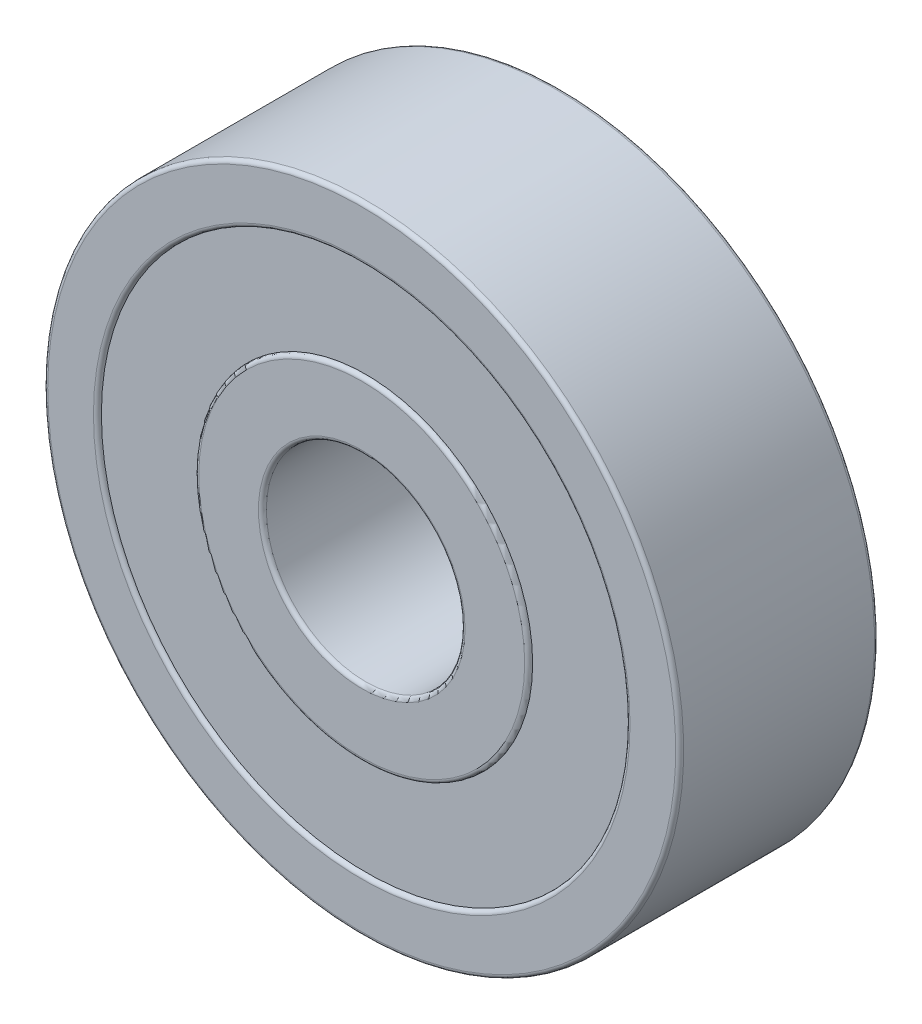
ISO-10303-21;
HEADER;
FILE_DESCRIPTION(('STEP AP214'),'2;1');
FILE_NAME('part.step','',(''),(''),'','','');
FILE_SCHEMA(('AUTOMOTIVE_DESIGN { 1 0 10303 214 1 1 1 1 }'));
ENDSEC;
DATA;
#1=APPLICATION_CONTEXT('core data for automotive mechanical design processes');
#2=APPLICATION_PROTOCOL_DEFINITION('international standard','automotive_design',2000,#1);
#3=PRODUCT_CONTEXT('',#1,'mechanical');
#4=PRODUCT('Part','Part','',(#3));
#5=PRODUCT_RELATED_PRODUCT_CATEGORY('part','',(#4));
#6=PRODUCT_DEFINITION_FORMATION('','',#4);
#7=PRODUCT_DEFINITION_CONTEXT('part definition',#1,'design');
#8=PRODUCT_DEFINITION('design','',#6,#7);
#9=PRODUCT_DEFINITION_SHAPE('','',#8);
#10=(LENGTH_UNIT() NAMED_UNIT(*) SI_UNIT(.MILLI.,.METRE.));
#11=(NAMED_UNIT(*) PLANE_ANGLE_UNIT() SI_UNIT($,.RADIAN.));
#12=(NAMED_UNIT(*) SI_UNIT($,.STERADIAN.) SOLID_ANGLE_UNIT());
#13=UNCERTAINTY_MEASURE_WITH_UNIT(LENGTH_MEASURE(1.E-05),#10,'distance_accuracy_value','');
#14=(GEOMETRIC_REPRESENTATION_CONTEXT(3) GLOBAL_UNCERTAINTY_ASSIGNED_CONTEXT((#13)) GLOBAL_UNIT_ASSIGNED_CONTEXT((#10,
#11,#12)) REPRESENTATION_CONTEXT('',''));
#15=CARTESIAN_POINT('',(0.,0.,0.));
#16=DIRECTION('',(0.,0.,1.));
#17=DIRECTION('',(1.,0.,0.));
#18=AXIS2_PLACEMENT_3D('',#15,#16,#17);
#19=CARTESIAN_POINT('',(0.,0.,4.));
#20=DIRECTION('',(0.,0.,1.));
#21=DIRECTION('',(1.,0.,0.));
#22=AXIS2_PLACEMENT_3D('',#19,#20,#21);
#23=PLANE('',#22);
#24=CARTESIAN_POINT('',(0.,0.,4.));
#25=DIRECTION('',(0.,0.,1.));
#26=DIRECTION('',(-1.,0.,0.));
#27=AXIS2_PLACEMENT_3D('',#24,#25,#26);
#28=CIRCLE('',#27,4.2);
#29=CARTESIAN_POINT('',(4.2,0.,4.));
#30=VERTEX_POINT('',#29);
#31=EDGE_CURVE('P0_E130',#30,#30,#28,.T.);
#32=ORIENTED_EDGE('',*,*,#31,.F.);
#33=EDGE_LOOP('',(#32));
#34=FACE_BOUND('',#33,.T.);
#35=CARTESIAN_POINT('',(0.,0.,4.));
#36=DIRECTION('',(0.,0.,-1.));
#37=DIRECTION('',(-1.,0.,0.));
#38=AXIS2_PLACEMENT_3D('',#35,#36,#37);
#39=CIRCLE('',#38,6.65);
#40=CARTESIAN_POINT('',(6.65,0.,4.));
#41=VERTEX_POINT('',#40);
#42=EDGE_CURVE('P0_E235',#41,#41,#39,.T.);
#43=ORIENTED_EDGE('',*,*,#42,.F.);
#44=EDGE_LOOP('',(#43));
#45=FACE_BOUND('',#44,.T.);
#46=ADVANCED_FACE('P0_F17',(#34,#45),#23,.T.);
#47=CARTESIAN_POINT('',(0.,0.,1.));
#48=DIRECTION('',(0.,0.,-1.));
#49=DIRECTION('',(0.,-1.,0.));
#50=AXIS2_PLACEMENT_3D('',#47,#48,#49);
#51=PLANE('',#50);
#52=CARTESIAN_POINT('',(0.,0.,1.));
#53=DIRECTION('',(0.,0.,-1.));
#54=DIRECTION('',(1.,0.,0.));
#55=AXIS2_PLACEMENT_3D('',#52,#53,#54);
#56=CIRCLE('',#55,4.2);
#57=CARTESIAN_POINT('',(-4.2,0.,1.));
#58=VERTEX_POINT('',#57);
#59=EDGE_CURVE('P0_E185',#58,#58,#56,.T.);
#60=ORIENTED_EDGE('',*,*,#59,.F.);
#61=EDGE_LOOP('',(#60));
#62=FACE_BOUND('',#61,.T.);
#63=CARTESIAN_POINT('',(0.,0.,1.));
#64=DIRECTION('',(0.,0.,1.));
#65=DIRECTION('',(1.,0.,0.));
#66=AXIS2_PLACEMENT_3D('',#63,#64,#65);
#67=CIRCLE('',#66,6.65);
#68=CARTESIAN_POINT('',(-6.65,0.,1.));
#69=VERTEX_POINT('',#68);
#70=EDGE_CURVE('P0_E226',#69,#69,#67,.T.);
#71=ORIENTED_EDGE('',*,*,#70,.F.);
#72=EDGE_LOOP('',(#71));
#73=FACE_BOUND('',#72,.T.);
#74=ADVANCED_FACE('P0_F19',(#62,#73),#51,.T.);
#75=CARTESIAN_POINT('',(0.,0.,4.9));
#76=DIRECTION('',(0.,0.,1.));
#77=DIRECTION('',(1.,0.,0.));
#78=AXIS2_PLACEMENT_3D('',#75,#76,#77);
#79=TOROIDAL_SURFACE('',#78,7.9,0.1);
#80=CARTESIAN_POINT('',(0.,0.,5.));
#81=DIRECTION('',(0.,0.,-1.));
#82=DIRECTION('',(1.,0.,0.));
#83=AXIS2_PLACEMENT_3D('',#80,#81,#82);
#84=CIRCLE('',#83,7.9);
#85=CARTESIAN_POINT('',(-7.9,0.,5.));
#86=VERTEX_POINT('',#85);
#87=EDGE_CURVE('P0_E254',#86,#86,#84,.T.);
#88=ORIENTED_EDGE('',*,*,#87,.T.);
#89=CARTESIAN_POINT('',(-7.9,0.,4.9));
#90=DIRECTION('',(0.,-1.,0.));
#91=DIRECTION('',(-1.,0.,0.));
#92=AXIS2_PLACEMENT_3D('',#89,#90,#91);
#93=CIRCLE('',#92,0.1);
#94=CARTESIAN_POINT('',(-8.,0.,4.9));
#95=VERTEX_POINT('',#94);
#96=EDGE_CURVE('P0_E11',#86,#95,#93,.T.);
#97=ORIENTED_EDGE('',*,*,#96,.T.);
#98=CARTESIAN_POINT('',(0.,0.,4.9));
#99=DIRECTION('',(0.,0.,1.));
#100=DIRECTION('',(1.,0.,0.));
#101=AXIS2_PLACEMENT_3D('',#98,#99,#100);
#102=CIRCLE('',#101,8.);
#103=EDGE_CURVE('P0_E201',#95,#95,#102,.T.);
#104=ORIENTED_EDGE('',*,*,#103,.T.);
#105=ORIENTED_EDGE('',*,*,#96,.F.);
#106=EDGE_LOOP('',(#88,#97,#104,#105));
#107=FACE_BOUND('',#106,.T.);
#108=ADVANCED_FACE('P0_F292',(#107),#79,.T.);
#109=CARTESIAN_POINT('',(0.,0.,0.));
#110=DIRECTION('',(0.,0.,1.));
#111=DIRECTION('',(1.,0.,0.));
#112=AXIS2_PLACEMENT_3D('',#109,#110,#111);
#113=CYLINDRICAL_SURFACE('',#112,8.);
#114=ORIENTED_EDGE('',*,*,#103,.F.);
#115=DIRECTION('',(0.,0.,-1.));
#116=VECTOR('',#115,1.);
#117=CARTESIAN_POINT('',(-8.,0.,0.));
#118=LINE('',#117,#116);
#119=CARTESIAN_POINT('',(-8.,0.,0.1));
#120=VERTEX_POINT('',#119);
#121=EDGE_CURVE('P0_E27',#95,#120,#118,.T.);
#122=ORIENTED_EDGE('',*,*,#121,.T.);
#123=CARTESIAN_POINT('',(0.,0.,0.1));
#124=DIRECTION('',(0.,0.,-1.));
#125=DIRECTION('',(1.,0.,0.));
#126=AXIS2_PLACEMENT_3D('',#123,#124,#125);
#127=CIRCLE('',#126,8.);
#128=EDGE_CURVE('P0_E137',#120,#120,#127,.T.);
#129=ORIENTED_EDGE('',*,*,#128,.F.);
#130=ORIENTED_EDGE('',*,*,#121,.F.);
#131=EDGE_LOOP('',(#114,#122,#129,#130));
#132=FACE_BOUND('',#131,.T.);
#133=ADVANCED_FACE('P0_F210',(#132),#113,.T.);
#134=CARTESIAN_POINT('',(0.,0.,0.1));
#135=DIRECTION('',(0.,0.,1.));
#136=DIRECTION('',(1.,0.,0.));
#137=AXIS2_PLACEMENT_3D('',#134,#135,#136);
#138=TOROIDAL_SURFACE('',#137,7.9,0.1);
#139=ORIENTED_EDGE('',*,*,#128,.T.);
#140=CARTESIAN_POINT('',(-7.9,0.,0.1));
#141=DIRECTION('',(0.,-1.,0.));
#142=DIRECTION('',(-1.,0.,0.));
#143=AXIS2_PLACEMENT_3D('',#140,#141,#142);
#144=CIRCLE('',#143,0.1);
#145=CARTESIAN_POINT('',(-7.9,0.,0.));
#146=VERTEX_POINT('',#145);
#147=EDGE_CURVE('P0_E145',#120,#146,#144,.T.);
#148=ORIENTED_EDGE('',*,*,#147,.T.);
#149=CARTESIAN_POINT('',(0.,0.,0.));
#150=DIRECTION('',(0.,0.,1.));
#151=DIRECTION('',(1.,0.,0.));
#152=AXIS2_PLACEMENT_3D('',#149,#150,#151);
#153=CIRCLE('',#152,7.9);
#154=EDGE_CURVE('P0_E215',#146,#146,#153,.T.);
#155=ORIENTED_EDGE('',*,*,#154,.T.);
#156=ORIENTED_EDGE('',*,*,#147,.F.);
#157=EDGE_LOOP('',(#139,#148,#155,#156));
#158=FACE_BOUND('',#157,.T.);
#159=ADVANCED_FACE('P0_F213',(#158),#138,.T.);
#160=CARTESIAN_POINT('',(0.,0.,5.));
#161=DIRECTION('',(0.,0.,-1.));
#162=DIRECTION('',(-1.,0.,0.));
#163=AXIS2_PLACEMENT_3D('',#160,#161,#162);
#164=CYLINDRICAL_SURFACE('',#163,4.2);
#165=CARTESIAN_POINT('',(0.,0.,4.9));
#166=DIRECTION('',(0.,0.,1.));
#167=DIRECTION('',(-1.,0.,0.));
#168=AXIS2_PLACEMENT_3D('',#165,#166,#167);
#169=CIRCLE('',#168,4.2);
#170=CARTESIAN_POINT('',(4.2,0.,4.9));
#171=VERTEX_POINT('',#170);
#172=CARTESIAN_POINT('',(-4.2,0.,4.9));
#173=VERTEX_POINT('',#172);
#174=EDGE_CURVE('P0_E147',#171,#173,#169,.T.);
#175=ORIENTED_EDGE('',*,*,#174,.F.);
#176=DIRECTION('',(0.,0.,-1.));
#177=VECTOR('',#176,1.);
#178=CARTESIAN_POINT('',(4.2,0.,5.));
#179=LINE('',#178,#177);
#180=EDGE_CURVE('P0_E134',#171,#30,#179,.T.);
#181=ORIENTED_EDGE('',*,*,#180,.T.);
#182=ORIENTED_EDGE('',*,*,#31,.T.);
#183=ORIENTED_EDGE('',*,*,#180,.F.);
#184=CARTESIAN_POINT('',(0.,0.,4.9));
#185=DIRECTION('',(0.,0.,1.));
#186=DIRECTION('',(-1.,0.,0.));
#187=AXIS2_PLACEMENT_3D('',#184,#185,#186);
#188=CIRCLE('',#187,4.2);
#189=EDGE_CURVE('P0_E193',#173,#171,#188,.T.);
#190=ORIENTED_EDGE('',*,*,#189,.F.);
#191=EDGE_LOOP('',(#175,#181,#182,#183,#190));
#192=FACE_BOUND('',#191,.T.);
#193=ADVANCED_FACE('P0_F132',(#192),#164,.T.);
#194=CARTESIAN_POINT('',(0.,0.,4.9));
#195=DIRECTION('',(0.,0.,1.));
#196=DIRECTION('',(1.,0.,0.));
#197=AXIS2_PLACEMENT_3D('',#194,#195,#196);
#198=TOROIDAL_SURFACE('',#197,4.1,0.1);
#199=CARTESIAN_POINT('',(0.,0.,5.));
#200=DIRECTION('',(0.,0.,-1.));
#201=DIRECTION('',(-1.,0.,0.));
#202=AXIS2_PLACEMENT_3D('',#199,#200,#201);
#203=CIRCLE('',#202,4.1);
#204=CARTESIAN_POINT('',(-4.1,0.,5.));
#205=VERTEX_POINT('',#204);
#206=EDGE_CURVE('P0_E172',#205,#205,#203,.T.);
#207=ORIENTED_EDGE('',*,*,#206,.T.);
#208=CARTESIAN_POINT('',(-4.1,0.,4.9));
#209=DIRECTION('',(0.,-1.,0.));
#210=DIRECTION('',(-1.,0.,0.));
#211=AXIS2_PLACEMENT_3D('',#208,#209,#210);
#212=CIRCLE('',#211,0.1);
#213=EDGE_CURVE('P0_E189',#205,#173,#212,.T.);
#214=ORIENTED_EDGE('',*,*,#213,.T.);
#215=ORIENTED_EDGE('',*,*,#189,.T.);
#216=ORIENTED_EDGE('',*,*,#174,.T.);
#217=ORIENTED_EDGE('',*,*,#213,.F.);
#218=EDGE_LOOP('',(#207,#214,#215,#216,#217));
#219=FACE_BOUND('',#218,.T.);
#220=ADVANCED_FACE('P0_F341',(#219),#198,.T.);
#221=CARTESIAN_POINT('',(0.,0.,0.));
#222=DIRECTION('',(0.,0.,1.));
#223=DIRECTION('',(1.,0.,0.));
#224=AXIS2_PLACEMENT_3D('',#221,#222,#223);
#225=CYLINDRICAL_SURFACE('',#224,4.2);
#226=CARTESIAN_POINT('',(0.,0.,0.1));
#227=DIRECTION('',(0.,0.,-1.));
#228=DIRECTION('',(1.,0.,0.));
#229=AXIS2_PLACEMENT_3D('',#226,#227,#228);
#230=CIRCLE('',#229,4.2);
#231=CARTESIAN_POINT('',(-4.2,0.,0.1));
#232=VERTEX_POINT('',#231);
#233=CARTESIAN_POINT('',(4.2,0.,0.1));
#234=VERTEX_POINT('',#233);
#235=EDGE_CURVE('P0_E186',#232,#234,#230,.T.);
#236=ORIENTED_EDGE('',*,*,#235,.F.);
#237=DIRECTION('',(0.,0.,1.));
#238=VECTOR('',#237,1.);
#239=CARTESIAN_POINT('',(-4.2,0.,0.));
#240=LINE('',#239,#238);
#241=EDGE_CURVE('P0_E181',#232,#58,#240,.T.);
#242=ORIENTED_EDGE('',*,*,#241,.T.);
#243=ORIENTED_EDGE('',*,*,#59,.T.);
#244=ORIENTED_EDGE('',*,*,#241,.F.);
#245=CARTESIAN_POINT('',(0.,0.,0.1));
#246=DIRECTION('',(0.,0.,-1.));
#247=DIRECTION('',(1.,0.,0.));
#248=AXIS2_PLACEMENT_3D('',#245,#246,#247);
#249=CIRCLE('',#248,4.2);
#250=EDGE_CURVE('P0_E180',#234,#232,#249,.T.);
#251=ORIENTED_EDGE('',*,*,#250,.F.);
#252=EDGE_LOOP('',(#236,#242,#243,#244,#251));
#253=FACE_BOUND('',#252,.T.);
#254=ADVANCED_FACE('P0_F344',(#253),#225,.T.);
#255=CARTESIAN_POINT('',(0.,0.,0.1));
#256=DIRECTION('',(0.,0.,-1.));
#257=DIRECTION('',(-1.,0.,0.));
#258=AXIS2_PLACEMENT_3D('',#255,#256,#257);
#259=TOROIDAL_SURFACE('',#258,4.1,0.1);
#260=CARTESIAN_POINT('',(0.,0.,0.));
#261=DIRECTION('',(0.,0.,1.));
#262=DIRECTION('',(1.,0.,0.));
#263=AXIS2_PLACEMENT_3D('',#260,#261,#262);
#264=CIRCLE('',#263,4.1);
#265=CARTESIAN_POINT('',(4.1,0.,0.));
#266=VERTEX_POINT('',#265);
#267=EDGE_CURVE('P0_E164',#266,#266,#264,.T.);
#268=ORIENTED_EDGE('',*,*,#267,.T.);
#269=CARTESIAN_POINT('',(4.1,0.,0.1));
#270=DIRECTION('',(0.,-1.,0.));
#271=DIRECTION('',(1.,0.,0.));
#272=AXIS2_PLACEMENT_3D('',#269,#270,#271);
#273=CIRCLE('',#272,0.1);
#274=EDGE_CURVE('P0_E176',#266,#234,#273,.T.);
#275=ORIENTED_EDGE('',*,*,#274,.T.);
#276=ORIENTED_EDGE('',*,*,#250,.T.);
#277=ORIENTED_EDGE('',*,*,#235,.T.);
#278=ORIENTED_EDGE('',*,*,#274,.F.);
#279=EDGE_LOOP('',(#268,#275,#276,#277,#278));
#280=FACE_BOUND('',#279,.T.);
#281=ADVANCED_FACE('P0_F348',(#280),#259,.T.);
#282=CARTESIAN_POINT('',(0.,0.,5.));
#283=DIRECTION('',(0.,0.,1.));
#284=DIRECTION('',(1.,0.,0.));
#285=AXIS2_PLACEMENT_3D('',#282,#283,#284);
#286=PLANE('',#285);
#287=CARTESIAN_POINT('',(0.,0.,5.));
#288=DIRECTION('',(0.,0.,1.));
#289=DIRECTION('',(1.,0.,0.));
#290=AXIS2_PLACEMENT_3D('',#287,#288,#289);
#291=CIRCLE('',#290,2.6);
#292=CARTESIAN_POINT('',(2.6,0.,5.));
#293=VERTEX_POINT('',#292);
#294=EDGE_CURVE('P0_E168',#293,#293,#291,.T.);
#295=ORIENTED_EDGE('',*,*,#294,.F.);
#296=EDGE_LOOP('',(#295));
#297=FACE_BOUND('',#296,.T.);
#298=ORIENTED_EDGE('',*,*,#206,.F.);
#299=EDGE_LOOP('',(#298));
#300=FACE_BOUND('',#299,.T.);
#301=ADVANCED_FACE('P0_F317',(#297,#300),#286,.T.);
#302=CARTESIAN_POINT('',(0.,0.,4.9));
#303=DIRECTION('',(0.,0.,-1.));
#304=DIRECTION('',(-1.,0.,0.));
#305=AXIS2_PLACEMENT_3D('',#302,#303,#304);
#306=TOROIDAL_SURFACE('',#305,2.6,0.1);
#307=ORIENTED_EDGE('',*,*,#294,.T.);
#308=CARTESIAN_POINT('',(2.6,0.,4.9));
#309=DIRECTION('',(0.,-1.,0.));
#310=DIRECTION('',(1.,0.,0.));
#311=AXIS2_PLACEMENT_3D('',#308,#309,#310);
#312=CIRCLE('',#311,0.1);
#313=CARTESIAN_POINT('',(2.5,0.,4.9));
#314=VERTEX_POINT('',#313);
#315=EDGE_CURVE('P0_E169',#293,#314,#312,.T.);
#316=ORIENTED_EDGE('',*,*,#315,.T.);
#317=CARTESIAN_POINT('',(0.,0.,4.9));
#318=DIRECTION('',(0.,0.,-1.));
#319=DIRECTION('',(1.,0.,0.));
#320=AXIS2_PLACEMENT_3D('',#317,#318,#319);
#321=CIRCLE('',#320,2.5);
#322=CARTESIAN_POINT('',(-2.5,0.,4.9));
#323=VERTEX_POINT('',#322);
#324=EDGE_CURVE('P0_E161',#314,#323,#321,.T.);
#325=ORIENTED_EDGE('',*,*,#324,.T.);
#326=CARTESIAN_POINT('',(0.,0.,4.9));
#327=DIRECTION('',(0.,0.,-1.));
#328=DIRECTION('',(1.,0.,0.));
#329=AXIS2_PLACEMENT_3D('',#326,#327,#328);
#330=CIRCLE('',#329,2.5);
#331=EDGE_CURVE('P0_E153',#323,#314,#330,.T.);
#332=ORIENTED_EDGE('',*,*,#331,.T.);
#333=ORIENTED_EDGE('',*,*,#315,.F.);
#334=EDGE_LOOP('',(#307,#316,#325,#332,#333));
#335=FACE_BOUND('',#334,.T.);
#336=ADVANCED_FACE('P0_F311',(#335),#306,.T.);
#337=CARTESIAN_POINT('',(0.,0.,0.));
#338=DIRECTION('',(0.,0.,1.));
#339=DIRECTION('',(1.,0.,0.));
#340=AXIS2_PLACEMENT_3D('',#337,#338,#339);
#341=PLANE('',#340);
#342=CARTESIAN_POINT('',(0.,0.,0.));
#343=DIRECTION('',(0.,0.,-1.));
#344=DIRECTION('',(1.,0.,0.));
#345=AXIS2_PLACEMENT_3D('',#342,#343,#344);
#346=CIRCLE('',#345,2.6);
#347=CARTESIAN_POINT('',(2.6,0.,0.));
#348=VERTEX_POINT('',#347);
#349=EDGE_CURVE('P0_E151',#348,#348,#346,.T.);
#350=ORIENTED_EDGE('',*,*,#349,.F.);
#351=EDGE_LOOP('',(#350));
#352=FACE_BOUND('',#351,.T.);
#353=ORIENTED_EDGE('',*,*,#267,.F.);
#354=EDGE_LOOP('',(#353));
#355=FACE_BOUND('',#354,.T.);
#356=ADVANCED_FACE('P0_F307',(#352,#355),#341,.F.);
#357=CARTESIAN_POINT('',(0.,0.,0.));
#358=DIRECTION('',(0.,0.,1.));
#359=DIRECTION('',(1.,0.,0.));
#360=AXIS2_PLACEMENT_3D('',#357,#358,#359);
#361=CYLINDRICAL_SURFACE('',#360,2.5);
#362=ORIENTED_EDGE('',*,*,#331,.F.);
#363=DIRECTION('',(0.,0.,-1.));
#364=VECTOR('',#363,1.);
#365=CARTESIAN_POINT('',(-2.5,0.,0.));
#366=LINE('',#365,#364);
#367=CARTESIAN_POINT('',(-2.5,0.,0.1));
#368=VERTEX_POINT('',#367);
#369=EDGE_CURVE('P0_E157',#323,#368,#366,.T.);
#370=ORIENTED_EDGE('',*,*,#369,.T.);
#371=CARTESIAN_POINT('',(0.,0.,0.1));
#372=DIRECTION('',(0.,0.,1.));
#373=DIRECTION('',(1.,0.,0.));
#374=AXIS2_PLACEMENT_3D('',#371,#372,#373);
#375=CIRCLE('',#374,2.5);
#376=CARTESIAN_POINT('',(2.5,0.,0.1));
#377=VERTEX_POINT('',#376);
#378=EDGE_CURVE('P0_E158',#377,#368,#375,.T.);
#379=ORIENTED_EDGE('',*,*,#378,.F.);
#380=CARTESIAN_POINT('',(0.,0.,0.1));
#381=DIRECTION('',(0.,0.,1.));
#382=DIRECTION('',(1.,0.,0.));
#383=AXIS2_PLACEMENT_3D('',#380,#381,#382);
#384=CIRCLE('',#383,2.5);
#385=EDGE_CURVE('P0_E250',#368,#377,#384,.T.);
#386=ORIENTED_EDGE('',*,*,#385,.F.);
#387=ORIENTED_EDGE('',*,*,#369,.F.);
#388=ORIENTED_EDGE('',*,*,#324,.F.);
#389=EDGE_LOOP('',(#362,#370,#379,#386,#387,#388));
#390=FACE_BOUND('',#389,.T.);
#391=ADVANCED_FACE('P0_F310',(#390),#361,.F.);
#392=CARTESIAN_POINT('',(0.,0.,0.1));
#393=DIRECTION('',(0.,0.,-1.));
#394=DIRECTION('',(-1.,0.,0.));
#395=AXIS2_PLACEMENT_3D('',#392,#393,#394);
#396=TOROIDAL_SURFACE('',#395,2.6,0.1);
#397=ORIENTED_EDGE('',*,*,#385,.T.);
#398=CARTESIAN_POINT('',(2.6,0.,0.1));
#399=DIRECTION('',(0.,-1.,0.));
#400=DIRECTION('',(1.,0.,0.));
#401=AXIS2_PLACEMENT_3D('',#398,#399,#400);
#402=CIRCLE('',#401,0.1);
#403=EDGE_CURVE('P0_E255',#377,#348,#402,.T.);
#404=ORIENTED_EDGE('',*,*,#403,.T.);
#405=ORIENTED_EDGE('',*,*,#349,.T.);
#406=ORIENTED_EDGE('',*,*,#403,.F.);
#407=ORIENTED_EDGE('',*,*,#378,.T.);
#408=EDGE_LOOP('',(#397,#404,#405,#406,#407));
#409=FACE_BOUND('',#408,.T.);
#410=ADVANCED_FACE('P0_F333',(#409),#396,.T.);
#411=CARTESIAN_POINT('',(0.,0.,0.));
#412=DIRECTION('',(0.,0.,1.));
#413=DIRECTION('',(1.,0.,0.));
#414=AXIS2_PLACEMENT_3D('',#411,#412,#413);
#415=CYLINDRICAL_SURFACE('',#414,6.65);
#416=CARTESIAN_POINT('',(0.,0.,0.1));
#417=DIRECTION('',(0.,0.,1.));
#418=DIRECTION('',(1.,0.,0.));
#419=AXIS2_PLACEMENT_3D('',#416,#417,#418);
#420=CIRCLE('',#419,6.65);
#421=CARTESIAN_POINT('',(-6.65,0.,0.1));
#422=VERTEX_POINT('',#421);
#423=EDGE_CURVE('P0_E219',#422,#422,#420,.T.);
#424=ORIENTED_EDGE('',*,*,#423,.F.);
#425=DIRECTION('',(0.,0.,1.));
#426=VECTOR('',#425,1.);
#427=CARTESIAN_POINT('',(-6.65,0.,0.));
#428=LINE('',#427,#426);
#429=EDGE_CURVE('P0_E218',#422,#69,#428,.T.);
#430=ORIENTED_EDGE('',*,*,#429,.T.);
#431=ORIENTED_EDGE('',*,*,#70,.T.);
#432=ORIENTED_EDGE('',*,*,#429,.F.);
#433=EDGE_LOOP('',(#424,#430,#431,#432));
#434=FACE_BOUND('',#433,.T.);
#435=ADVANCED_FACE('P0_F329',(#434),#415,.F.);
#436=CARTESIAN_POINT('',(0.,0.,0.));
#437=DIRECTION('',(0.,0.,1.));
#438=DIRECTION('',(1.,0.,0.));
#439=AXIS2_PLACEMENT_3D('',#436,#437,#438);
#440=PLANE('',#439);
#441=CARTESIAN_POINT('',(0.,0.,0.));
#442=DIRECTION('',(0.,0.,-1.));
#443=DIRECTION('',(1.,0.,0.));
#444=AXIS2_PLACEMENT_3D('',#441,#442,#443);
#445=CIRCLE('',#444,6.75);
#446=CARTESIAN_POINT('',(-6.75,0.,0.));
#447=VERTEX_POINT('',#446);
#448=EDGE_CURVE('P0_E234',#447,#447,#445,.T.);
#449=ORIENTED_EDGE('',*,*,#448,.F.);
#450=EDGE_LOOP('',(#449));
#451=FACE_BOUND('',#450,.T.);
#452=ORIENTED_EDGE('',*,*,#154,.F.);
#453=EDGE_LOOP('',(#452));
#454=FACE_BOUND('',#453,.T.);
#455=ADVANCED_FACE('P0_F325',(#451,#454),#440,.F.);
#456=CARTESIAN_POINT('',(0.,0.,0.1));
#457=DIRECTION('',(0.,0.,1.));
#458=DIRECTION('',(1.,0.,0.));
#459=AXIS2_PLACEMENT_3D('',#456,#457,#458);
#460=TOROIDAL_SURFACE('',#459,6.75,0.1);
#461=ORIENTED_EDGE('',*,*,#448,.T.);
#462=CARTESIAN_POINT('',(-6.75,0.,0.1));
#463=DIRECTION('',(0.,-1.,0.));
#464=DIRECTION('',(-1.,0.,0.));
#465=AXIS2_PLACEMENT_3D('',#462,#463,#464);
#466=CIRCLE('',#465,0.1);
#467=EDGE_CURVE('P0_E228',#447,#422,#466,.T.);
#468=ORIENTED_EDGE('',*,*,#467,.T.);
#469=ORIENTED_EDGE('',*,*,#423,.T.);
#470=ORIENTED_EDGE('',*,*,#467,.F.);
#471=EDGE_LOOP('',(#461,#468,#469,#470));
#472=FACE_BOUND('',#471,.T.);
#473=ADVANCED_FACE('P0_F320',(#472),#460,.T.);
#474=CARTESIAN_POINT('',(0.,0.,5.));
#475=DIRECTION('',(0.,0.,-1.));
#476=DIRECTION('',(-1.,0.,0.));
#477=AXIS2_PLACEMENT_3D('',#474,#475,#476);
#478=CYLINDRICAL_SURFACE('',#477,6.65);
#479=CARTESIAN_POINT('',(0.,0.,4.9));
#480=DIRECTION('',(0.,0.,-1.));
#481=DIRECTION('',(-1.,0.,0.));
#482=AXIS2_PLACEMENT_3D('',#479,#480,#481);
#483=CIRCLE('',#482,6.65);
#484=CARTESIAN_POINT('',(6.65,0.,4.9));
#485=VERTEX_POINT('',#484);
#486=EDGE_CURVE('P0_E264',#485,#485,#483,.T.);
#487=ORIENTED_EDGE('',*,*,#486,.F.);
#488=DIRECTION('',(0.,0.,-1.));
#489=VECTOR('',#488,1.);
#490=CARTESIAN_POINT('',(6.65,0.,5.));
#491=LINE('',#490,#489);
#492=EDGE_CURVE('P0_E238',#485,#41,#491,.T.);
#493=ORIENTED_EDGE('',*,*,#492,.T.);
#494=ORIENTED_EDGE('',*,*,#42,.T.);
#495=ORIENTED_EDGE('',*,*,#492,.F.);
#496=EDGE_LOOP('',(#487,#493,#494,#495));
#497=FACE_BOUND('',#496,.T.);
#498=ADVANCED_FACE('P0_F289',(#497),#478,.F.);
#499=CARTESIAN_POINT('',(0.,0.,5.));
#500=DIRECTION('',(0.,0.,1.));
#501=DIRECTION('',(1.,0.,0.));
#502=AXIS2_PLACEMENT_3D('',#499,#500,#501);
#503=PLANE('',#502);
#504=CARTESIAN_POINT('',(0.,0.,5.));
#505=DIRECTION('',(0.,0.,1.));
#506=DIRECTION('',(-1.,0.,0.));
#507=AXIS2_PLACEMENT_3D('',#504,#505,#506);
#508=CIRCLE('',#507,6.75);
#509=CARTESIAN_POINT('',(6.75,0.,5.));
#510=VERTEX_POINT('',#509);
#511=EDGE_CURVE('P0_E275',#510,#510,#508,.T.);
#512=ORIENTED_EDGE('',*,*,#511,.F.);
#513=EDGE_LOOP('',(#512));
#514=FACE_BOUND('',#513,.T.);
#515=ORIENTED_EDGE('',*,*,#87,.F.);
#516=EDGE_LOOP('',(#515));
#517=FACE_BOUND('',#516,.T.);
#518=ADVANCED_FACE('P0_F286',(#514,#517),#503,.T.);
#519=CARTESIAN_POINT('',(0.,0.,4.9));
#520=DIRECTION('',(0.,0.,-1.));
#521=DIRECTION('',(-1.,0.,0.));
#522=AXIS2_PLACEMENT_3D('',#519,#520,#521);
#523=TOROIDAL_SURFACE('',#522,6.75,0.1);
#524=ORIENTED_EDGE('',*,*,#511,.T.);
#525=CARTESIAN_POINT('',(6.75,0.,4.9));
#526=DIRECTION('',(0.,-1.,0.));
#527=DIRECTION('',(1.,0.,0.));
#528=AXIS2_PLACEMENT_3D('',#525,#526,#527);
#529=CIRCLE('',#528,0.1);
#530=EDGE_CURVE('P0_E268',#510,#485,#529,.T.);
#531=ORIENTED_EDGE('',*,*,#530,.T.);
#532=ORIENTED_EDGE('',*,*,#486,.T.);
#533=ORIENTED_EDGE('',*,*,#530,.F.);
#534=EDGE_LOOP('',(#524,#531,#532,#533));
#535=FACE_BOUND('',#534,.T.);
#536=ADVANCED_FACE('P0_F284',(#535),#523,.T.);
#537=CLOSED_SHELL('',(#46,#74,#108,#133,#159,#193,#220,#254,#281,#301,#336,#356,#391,#410,#435,
#455,#473,#498,#518,#536));
#538=MANIFOLD_SOLID_BREP('P0_B1',#537);
#539=CARTESIAN_POINT('',(0.,0.,4.));
#540=DIRECTION('',(0.,0.,1.));
#541=DIRECTION('',(1.,0.,0.));
#542=AXIS2_PLACEMENT_3D('',#539,#540,#541);
#543=PLANE('',#542);
#544=CARTESIAN_POINT('',(0.,0.,4.));
#545=DIRECTION('',(0.,0.,1.));
#546=DIRECTION('',(-1.,0.,0.));
#547=AXIS2_PLACEMENT_3D('',#544,#545,#546);
#548=CIRCLE('',#547,4.2);
#549=CARTESIAN_POINT('',(4.2,0.,4.));
#550=VERTEX_POINT('',#549);
#551=EDGE_CURVE('P1_E58',#550,#550,#548,.T.);
#552=ORIENTED_EDGE('',*,*,#551,.T.);
#553=EDGE_LOOP('',(#552));
#554=FACE_BOUND('',#553,.T.);
#555=CARTESIAN_POINT('',(0.,0.,4.));
#556=DIRECTION('',(0.,0.,-1.));
#557=DIRECTION('',(-1.,0.,0.));
#558=AXIS2_PLACEMENT_3D('',#555,#556,#557);
#559=CIRCLE('',#558,6.65);
#560=CARTESIAN_POINT('',(6.65,0.,4.));
#561=VERTEX_POINT('',#560);
#562=EDGE_CURVE('P1_E11',#561,#561,#559,.T.);
#563=ORIENTED_EDGE('',*,*,#562,.T.);
#564=EDGE_LOOP('',(#563));
#565=FACE_BOUND('',#564,.T.);
#566=ADVANCED_FACE('P1_F17',(#554,#565),#543,.F.);
#567=CARTESIAN_POINT('',(0.,0.,4.9));
#568=DIRECTION('',(0.,0.,1.));
#569=DIRECTION('',(1.,0.,0.));
#570=AXIS2_PLACEMENT_3D('',#567,#568,#569);
#571=PLANE('',#570);
#572=CARTESIAN_POINT('',(0.,0.,4.9));
#573=DIRECTION('',(0.,0.,-1.));
#574=DIRECTION('',(-1.,0.,0.));
#575=AXIS2_PLACEMENT_3D('',#572,#573,#574);
#576=CIRCLE('',#575,4.2);
#577=CARTESIAN_POINT('',(4.2,0.,4.9));
#578=VERTEX_POINT('',#577);
#579=EDGE_CURVE('P1_E57',#578,#578,#576,.T.);
#580=ORIENTED_EDGE('',*,*,#579,.T.);
#581=EDGE_LOOP('',(#580));
#582=FACE_BOUND('',#581,.T.);
#583=CARTESIAN_POINT('',(0.,0.,4.9));
#584=DIRECTION('',(0.,0.,1.));
#585=DIRECTION('',(-1.,0.,0.));
#586=AXIS2_PLACEMENT_3D('',#583,#584,#585);
#587=CIRCLE('',#586,6.65);
#588=CARTESIAN_POINT('',(6.65,0.,4.9));
#589=VERTEX_POINT('',#588);
#590=EDGE_CURVE('P1_E72',#589,#589,#587,.T.);
#591=ORIENTED_EDGE('',*,*,#590,.T.);
#592=EDGE_LOOP('',(#591));
#593=FACE_BOUND('',#592,.T.);
#594=ADVANCED_FACE('P1_F62',(#582,#593),#571,.T.);
#595=CARTESIAN_POINT('',(0.,0.,4.));
#596=DIRECTION('',(0.,0.,1.));
#597=DIRECTION('',(-1.,0.,0.));
#598=AXIS2_PLACEMENT_3D('',#595,#596,#597);
#599=CYLINDRICAL_SURFACE('',#598,6.65);
#600=ORIENTED_EDGE('',*,*,#590,.F.);
#601=DIRECTION('',(0.,0.,-1.));
#602=VECTOR('',#601,1.);
#603=CARTESIAN_POINT('',(6.65,0.,4.));
#604=LINE('',#603,#602);
#605=EDGE_CURVE('P1_E25',#589,#561,#604,.T.);
#606=ORIENTED_EDGE('',*,*,#605,.T.);
#607=ORIENTED_EDGE('',*,*,#562,.F.);
#608=ORIENTED_EDGE('',*,*,#605,.F.);
#609=EDGE_LOOP('',(#600,#606,#607,#608));
#610=FACE_BOUND('',#609,.T.);
#611=ADVANCED_FACE('P1_F77',(#610),#599,.T.);
#612=CARTESIAN_POINT('',(0.,0.,4.));
#613=DIRECTION('',(0.,0.,1.));
#614=DIRECTION('',(-1.,0.,0.));
#615=AXIS2_PLACEMENT_3D('',#612,#613,#614);
#616=CYLINDRICAL_SURFACE('',#615,4.2);
#617=ORIENTED_EDGE('',*,*,#579,.F.);
#618=DIRECTION('',(0.,0.,-1.));
#619=VECTOR('',#618,1.);
#620=CARTESIAN_POINT('',(4.2,0.,4.));
#621=LINE('',#620,#619);
#622=EDGE_CURVE('P1_E54',#578,#550,#621,.T.);
#623=ORIENTED_EDGE('',*,*,#622,.T.);
#624=ORIENTED_EDGE('',*,*,#551,.F.);
#625=ORIENTED_EDGE('',*,*,#622,.F.);
#626=EDGE_LOOP('',(#617,#623,#624,#625));
#627=FACE_BOUND('',#626,.T.);
#628=ADVANCED_FACE('P1_F56',(#627),#616,.F.);
#629=CLOSED_SHELL('',(#566,#594,#611,#628));
#630=MANIFOLD_SOLID_BREP('P1_B1',#629);
#631=CARTESIAN_POINT('',(0.,0.,1.));
#632=DIRECTION('',(0.,0.,-1.));
#633=DIRECTION('',(0.,-1.,0.));
#634=AXIS2_PLACEMENT_3D('',#631,#632,#633);
#635=PLANE('',#634);
#636=CARTESIAN_POINT('',(0.,0.,1.));
#637=DIRECTION('',(0.,0.,-1.));
#638=DIRECTION('',(1.,0.,0.));
#639=AXIS2_PLACEMENT_3D('',#636,#637,#638);
#640=CIRCLE('',#639,4.2);
#641=CARTESIAN_POINT('',(-4.2,0.,1.));
#642=VERTEX_POINT('',#641);
#643=EDGE_CURVE('P2_E43',#642,#642,#640,.T.);
#644=ORIENTED_EDGE('',*,*,#643,.T.);
#645=EDGE_LOOP('',(#644));
#646=FACE_BOUND('',#645,.T.);
#647=CARTESIAN_POINT('',(0.,0.,1.));
#648=DIRECTION('',(0.,0.,1.));
#649=DIRECTION('',(1.,0.,0.));
#650=AXIS2_PLACEMENT_3D('',#647,#648,#649);
#651=CIRCLE('',#650,6.65);
#652=CARTESIAN_POINT('',(-6.65,0.,1.));
#653=VERTEX_POINT('',#652);
#654=EDGE_CURVE('P2_E10',#653,#653,#651,.T.);
#655=ORIENTED_EDGE('',*,*,#654,.T.);
#656=EDGE_LOOP('',(#655));
#657=FACE_BOUND('',#656,.T.);
#658=ADVANCED_FACE('P2_F16',(#646,#657),#635,.F.);
#659=CARTESIAN_POINT('',(0.,0.,0.1));
#660=DIRECTION('',(0.,0.,-1.));
#661=DIRECTION('',(0.,-1.,0.));
#662=AXIS2_PLACEMENT_3D('',#659,#660,#661);
#663=PLANE('',#662);
#664=CARTESIAN_POINT('',(0.,0.,0.1));
#665=DIRECTION('',(0.,0.,1.));
#666=DIRECTION('',(1.,0.,0.));
#667=AXIS2_PLACEMENT_3D('',#664,#665,#666);
#668=CIRCLE('',#667,4.2);
#669=CARTESIAN_POINT('',(-4.2,0.,0.1));
#670=VERTEX_POINT('',#669);
#671=EDGE_CURVE('P2_E53',#670,#670,#668,.T.);
#672=ORIENTED_EDGE('',*,*,#671,.T.);
#673=EDGE_LOOP('',(#672));
#674=FACE_BOUND('',#673,.T.);
#675=CARTESIAN_POINT('',(0.,0.,0.1));
#676=DIRECTION('',(0.,0.,-1.));
#677=DIRECTION('',(1.,0.,0.));
#678=AXIS2_PLACEMENT_3D('',#675,#676,#677);
#679=CIRCLE('',#678,6.65);
#680=CARTESIAN_POINT('',(-6.65,0.,0.1));
#681=VERTEX_POINT('',#680);
#682=EDGE_CURVE('P2_E65',#681,#681,#679,.T.);
#683=ORIENTED_EDGE('',*,*,#682,.T.);
#684=EDGE_LOOP('',(#683));
#685=FACE_BOUND('',#684,.T.);
#686=ADVANCED_FACE('P2_F57',(#674,#685),#663,.T.);
#687=CARTESIAN_POINT('',(0.,0.,1.));
#688=DIRECTION('',(0.,0.,-1.));
#689=DIRECTION('',(1.,0.,0.));
#690=AXIS2_PLACEMENT_3D('',#687,#688,#689);
#691=CYLINDRICAL_SURFACE('',#690,6.65);
#692=ORIENTED_EDGE('',*,*,#682,.F.);
#693=DIRECTION('',(0.,0.,1.));
#694=VECTOR('',#693,1.);
#695=CARTESIAN_POINT('',(-6.65,0.,1.));
#696=LINE('',#695,#694);
#697=EDGE_CURVE('P2_E25',#681,#653,#696,.T.);
#698=ORIENTED_EDGE('',*,*,#697,.T.);
#699=ORIENTED_EDGE('',*,*,#654,.F.);
#700=ORIENTED_EDGE('',*,*,#697,.F.);
#701=EDGE_LOOP('',(#692,#698,#699,#700));
#702=FACE_BOUND('',#701,.T.);
#703=ADVANCED_FACE('P2_F78',(#702),#691,.T.);
#704=CARTESIAN_POINT('',(0.,0.,1.));
#705=DIRECTION('',(0.,0.,-1.));
#706=DIRECTION('',(1.,0.,0.));
#707=AXIS2_PLACEMENT_3D('',#704,#705,#706);
#708=CYLINDRICAL_SURFACE('',#707,4.2);
#709=ORIENTED_EDGE('',*,*,#671,.F.);
#710=DIRECTION('',(0.,0.,1.));
#711=VECTOR('',#710,1.);
#712=CARTESIAN_POINT('',(-4.2,0.,1.));
#713=LINE('',#712,#711);
#714=EDGE_CURVE('P2_E50',#670,#642,#713,.T.);
#715=ORIENTED_EDGE('',*,*,#714,.T.);
#716=ORIENTED_EDGE('',*,*,#643,.F.);
#717=ORIENTED_EDGE('',*,*,#714,.F.);
#718=EDGE_LOOP('',(#709,#715,#716,#717));
#719=FACE_BOUND('',#718,.T.);
#720=ADVANCED_FACE('P2_F52',(#719),#708,.F.);
#721=CLOSED_SHELL('',(#658,#686,#703,#720));
#722=MANIFOLD_SOLID_BREP('P2_B1',#721);
#723=ADVANCED_BREP_SHAPE_REPRESENTATION('',(#18,#538,#630,#722),#14);
#724=SHAPE_DEFINITION_REPRESENTATION(#9,#723);
ENDSEC;
END-ISO-10303-21;
